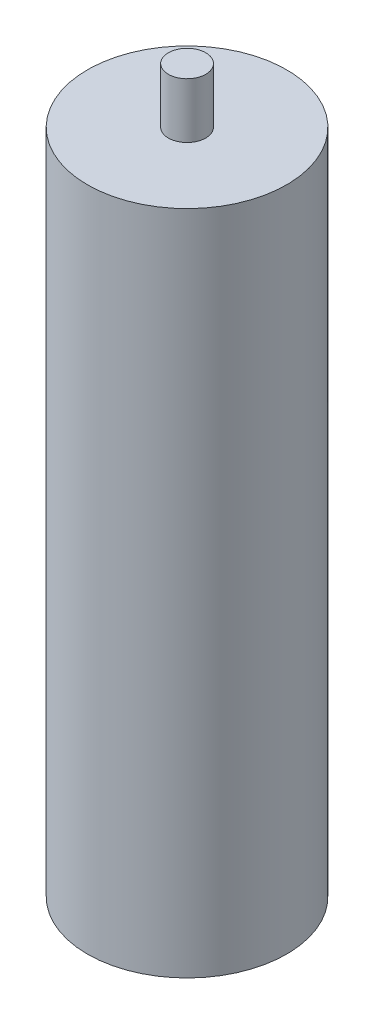
ISO-10303-21;
HEADER;
FILE_DESCRIPTION(('STEP AP214'),'2;1');
FILE_NAME('part.step','',(''),(''),'','','');
FILE_SCHEMA(('AUTOMOTIVE_DESIGN { 1 0 10303 214 1 1 1 1 }'));
ENDSEC;
DATA;
#1=APPLICATION_CONTEXT('core data for automotive mechanical design processes');
#2=APPLICATION_PROTOCOL_DEFINITION('international standard','automotive_design',2000,#1);
#3=PRODUCT_CONTEXT('',#1,'mechanical');
#4=PRODUCT('Part','Part','',(#3));
#5=PRODUCT_RELATED_PRODUCT_CATEGORY('part','',(#4));
#6=PRODUCT_DEFINITION_FORMATION('','',#4);
#7=PRODUCT_DEFINITION_CONTEXT('part definition',#1,'design');
#8=PRODUCT_DEFINITION('design','',#6,#7);
#9=PRODUCT_DEFINITION_SHAPE('','',#8);
#10=(LENGTH_UNIT() NAMED_UNIT(*) SI_UNIT(.MILLI.,.METRE.));
#11=(NAMED_UNIT(*) PLANE_ANGLE_UNIT() SI_UNIT($,.RADIAN.));
#12=(NAMED_UNIT(*) SI_UNIT($,.STERADIAN.) SOLID_ANGLE_UNIT());
#13=UNCERTAINTY_MEASURE_WITH_UNIT(LENGTH_MEASURE(1.E-05),#10,'distance_accuracy_value','');
#14=(GEOMETRIC_REPRESENTATION_CONTEXT(3) GLOBAL_UNCERTAINTY_ASSIGNED_CONTEXT((#13)) GLOBAL_UNIT_ASSIGNED_CONTEXT((#10,
#11,#12)) REPRESENTATION_CONTEXT('',''));
#15=CARTESIAN_POINT('',(0.,0.,0.));
#16=DIRECTION('',(0.,0.,1.));
#17=DIRECTION('',(1.,0.,0.));
#18=AXIS2_PLACEMENT_3D('',#15,#16,#17);
#19=CARTESIAN_POINT('',(0.,40.767,0.));
#20=DIRECTION('',(0.,-1.,0.));
#21=DIRECTION('',(0.,0.,-1.));
#22=AXIS2_PLACEMENT_3D('',#19,#20,#21);
#23=CYLINDRICAL_SURFACE('',#22,6.096);
#24=CARTESIAN_POINT('',(0.,40.767,0.));
#25=DIRECTION('',(0.,1.,0.));
#26=DIRECTION('',(0.,0.,1.));
#27=AXIS2_PLACEMENT_3D('',#24,#25,#26);
#28=CIRCLE('',#27,6.096);
#29=CARTESIAN_POINT('',(0.,40.767,6.096));
#30=VERTEX_POINT('',#29);
#31=EDGE_CURVE('E37',#30,#30,#28,.T.);
#32=ORIENTED_EDGE('',*,*,#31,.F.);
#33=EDGE_LOOP('',(#32));
#34=FACE_BOUND('',#33,.T.);
#35=CARTESIAN_POINT('',(0.,0.,0.));
#36=DIRECTION('',(0.,1.,0.));
#37=DIRECTION('',(0.,0.,1.));
#38=AXIS2_PLACEMENT_3D('',#35,#36,#37);
#39=CIRCLE('',#38,6.096);
#40=CARTESIAN_POINT('',(0.,0.,6.096));
#41=VERTEX_POINT('',#40);
#42=EDGE_CURVE('E41',#41,#41,#39,.T.);
#43=ORIENTED_EDGE('',*,*,#42,.T.);
#44=EDGE_LOOP('',(#43));
#45=FACE_BOUND('',#44,.T.);
#46=ADVANCED_FACE('F31',(#34,#45),#23,.T.);
#47=CARTESIAN_POINT('',(0.,40.767,0.));
#48=DIRECTION('',(0.,1.,0.));
#49=DIRECTION('',(0.,0.,1.));
#50=AXIS2_PLACEMENT_3D('',#47,#48,#49);
#51=PLANE('',#50);
#52=CARTESIAN_POINT('',(0.,40.767,0.));
#53=DIRECTION('',(0.,1.,0.));
#54=DIRECTION('',(0.,0.,1.));
#55=AXIS2_PLACEMENT_3D('',#52,#53,#54);
#56=CIRCLE('',#55,1.143);
#57=CARTESIAN_POINT('',(0.,40.767,1.143));
#58=VERTEX_POINT('',#57);
#59=EDGE_CURVE('E51',#58,#58,#56,.T.);
#60=ORIENTED_EDGE('',*,*,#59,.F.);
#61=EDGE_LOOP('',(#60));
#62=FACE_BOUND('',#61,.T.);
#63=ORIENTED_EDGE('',*,*,#31,.T.);
#64=EDGE_LOOP('',(#63));
#65=FACE_BOUND('',#64,.T.);
#66=ADVANCED_FACE('F66',(#62,#65),#51,.T.);
#67=CARTESIAN_POINT('',(0.,0.,0.));
#68=DIRECTION('',(0.,1.,0.));
#69=DIRECTION('',(0.,0.,1.));
#70=AXIS2_PLACEMENT_3D('',#67,#68,#69);
#71=PLANE('',#70);
#72=CARTESIAN_POINT('',(0.,0.,0.));
#73=DIRECTION('',(0.,1.,0.));
#74=DIRECTION('',(0.,0.,1.));
#75=AXIS2_PLACEMENT_3D('',#72,#73,#74);
#76=CIRCLE('',#75,1.143);
#77=CARTESIAN_POINT('',(0.,0.,1.143));
#78=VERTEX_POINT('',#77);
#79=EDGE_CURVE('E10',#78,#78,#76,.F.);
#80=ORIENTED_EDGE('',*,*,#79,.F.);
#81=EDGE_LOOP('',(#80));
#82=FACE_BOUND('',#81,.T.);
#83=ORIENTED_EDGE('',*,*,#42,.F.);
#84=EDGE_LOOP('',(#83));
#85=FACE_BOUND('',#84,.T.);
#86=ADVANCED_FACE('F68',(#82,#85),#71,.F.);
#87=CARTESIAN_POINT('',(0.,-3.3782,0.));
#88=DIRECTION('',(0.,1.,0.));
#89=DIRECTION('',(0.,0.,1.));
#90=AXIS2_PLACEMENT_3D('',#87,#88,#89);
#91=CYLINDRICAL_SURFACE('',#90,1.143);
#92=CARTESIAN_POINT('',(0.,-3.3782,0.));
#93=DIRECTION('',(0.,-1.,0.));
#94=DIRECTION('',(0.,0.,-1.));
#95=AXIS2_PLACEMENT_3D('',#92,#93,#94);
#96=CIRCLE('',#95,1.143);
#97=CARTESIAN_POINT('',(0.,-3.3782,-1.143));
#98=VERTEX_POINT('',#97);
#99=EDGE_CURVE('E46',#98,#98,#96,.T.);
#100=ORIENTED_EDGE('',*,*,#99,.F.);
#101=EDGE_LOOP('',(#100));
#102=FACE_BOUND('',#101,.T.);
#103=ORIENTED_EDGE('',*,*,#79,.T.);
#104=EDGE_LOOP('',(#103));
#105=FACE_BOUND('',#104,.T.);
#106=ADVANCED_FACE('F74',(#102,#105),#91,.T.);
#107=CARTESIAN_POINT('',(0.,-3.3782,0.));
#108=DIRECTION('',(0.,-1.,0.));
#109=DIRECTION('',(0.,0.,-1.));
#110=AXIS2_PLACEMENT_3D('',#107,#108,#109);
#111=PLANE('',#110);
#112=ORIENTED_EDGE('',*,*,#99,.T.);
#113=EDGE_LOOP('',(#112));
#114=FACE_BOUND('',#113,.T.);
#115=ADVANCED_FACE('F62',(#114),#111,.T.);
#116=CARTESIAN_POINT('',(0.,44.1452,0.));
#117=DIRECTION('',(0.,-1.,0.));
#118=DIRECTION('',(0.,0.,-1.));
#119=AXIS2_PLACEMENT_3D('',#116,#117,#118);
#120=CYLINDRICAL_SURFACE('',#119,1.143);
#121=CARTESIAN_POINT('',(0.,44.1452,0.));
#122=DIRECTION('',(0.,1.,0.));
#123=DIRECTION('',(0.,0.,1.));
#124=AXIS2_PLACEMENT_3D('',#121,#122,#123);
#125=CIRCLE('',#124,1.143);
#126=CARTESIAN_POINT('',(0.,44.1452,1.143));
#127=VERTEX_POINT('',#126);
#128=EDGE_CURVE('E50',#127,#127,#125,.T.);
#129=ORIENTED_EDGE('',*,*,#128,.F.);
#130=EDGE_LOOP('',(#129));
#131=FACE_BOUND('',#130,.T.);
#132=ORIENTED_EDGE('',*,*,#59,.T.);
#133=EDGE_LOOP('',(#132));
#134=FACE_BOUND('',#133,.T.);
#135=ADVANCED_FACE('F59',(#131,#134),#120,.T.);
#136=CARTESIAN_POINT('',(0.,44.1452,0.));
#137=DIRECTION('',(0.,1.,0.));
#138=DIRECTION('',(0.,0.,1.));
#139=AXIS2_PLACEMENT_3D('',#136,#137,#138);
#140=PLANE('',#139);
#141=ORIENTED_EDGE('',*,*,#128,.T.);
#142=EDGE_LOOP('',(#141));
#143=FACE_BOUND('',#142,.T.);
#144=ADVANCED_FACE('F57',(#143),#140,.T.);
#145=CLOSED_SHELL('',(#46,#66,#86,#106,#115,#135,#144));
#146=MANIFOLD_SOLID_BREP('B2',#145);
#147=ADVANCED_BREP_SHAPE_REPRESENTATION('',(#18,#146),#14);
#148=SHAPE_DEFINITION_REPRESENTATION(#9,#147);
ENDSEC;
END-ISO-10303-21;
